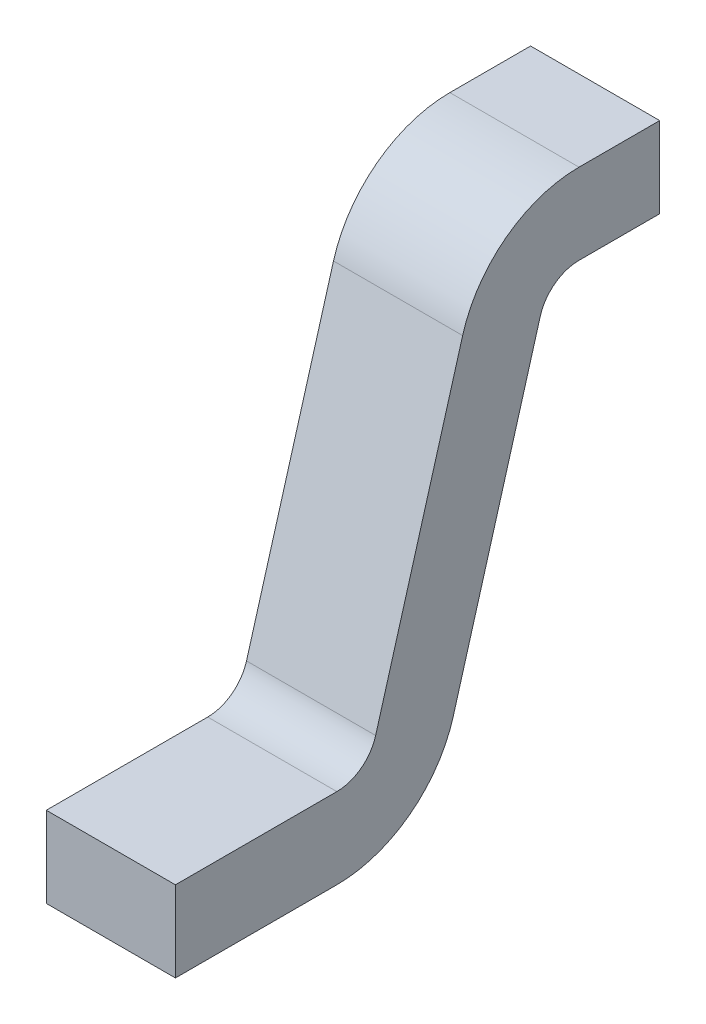
ISO-10303-21;
HEADER;
FILE_DESCRIPTION(('STEP AP214'),'2;1');
FILE_NAME('part.step','',(''),(''),'','','');
FILE_SCHEMA(('AUTOMOTIVE_DESIGN { 1 0 10303 214 1 1 1 1 }'));
ENDSEC;
DATA;
#1=APPLICATION_CONTEXT('core data for automotive mechanical design processes');
#2=APPLICATION_PROTOCOL_DEFINITION('international standard','automotive_design',2000,#1);
#3=PRODUCT_CONTEXT('',#1,'mechanical');
#4=PRODUCT('Part','Part','',(#3));
#5=PRODUCT_RELATED_PRODUCT_CATEGORY('part','',(#4));
#6=PRODUCT_DEFINITION_FORMATION('','',#4);
#7=PRODUCT_DEFINITION_CONTEXT('part definition',#1,'design');
#8=PRODUCT_DEFINITION('design','',#6,#7);
#9=PRODUCT_DEFINITION_SHAPE('','',#8);
#10=(LENGTH_UNIT() NAMED_UNIT(*) SI_UNIT(.MILLI.,.METRE.));
#11=(NAMED_UNIT(*) PLANE_ANGLE_UNIT() SI_UNIT($,.RADIAN.));
#12=(NAMED_UNIT(*) SI_UNIT($,.STERADIAN.) SOLID_ANGLE_UNIT());
#13=UNCERTAINTY_MEASURE_WITH_UNIT(LENGTH_MEASURE(1.E-05),#10,'distance_accuracy_value','');
#14=(GEOMETRIC_REPRESENTATION_CONTEXT(3) GLOBAL_UNCERTAINTY_ASSIGNED_CONTEXT((#13)) GLOBAL_UNIT_ASSIGNED_CONTEXT((#10,
#11,#12)) REPRESENTATION_CONTEXT('',''));
#15=CARTESIAN_POINT('',(0.,0.,0.));
#16=DIRECTION('',(0.,0.,1.));
#17=DIRECTION('',(1.,0.,0.));
#18=AXIS2_PLACEMENT_3D('',#15,#16,#17);
#19=CARTESIAN_POINT('',(0.2,-0.25,0.25));
#20=DIRECTION('',(1.,0.,0.));
#21=DIRECTION('',(0.,0.,-1.));
#22=AXIS2_PLACEMENT_3D('',#19,#20,#21);
#23=PLANE('',#22);
#24=DIRECTION('',(0.,0.961138338326591,-0.276067192181179));
#25=VECTOR('',#24,1.);
#26=CARTESIAN_POINT('',(0.2,-0.215491600977353,0.370142292290824));
#27=LINE('',#26,#25);
#28=CARTESIAN_POINT('',(0.2,-0.215491600977353,0.370142292290824));
#29=VERTEX_POINT('',#28);
#30=CARTESIAN_POINT('',(0.2,-1.15352519706794,0.639573123127529));
#31=VERTEX_POINT('',#30);
#32=EDGE_CURVE('E126',#29,#31,#27,.F.);
#33=ORIENTED_EDGE('',*,*,#32,.F.);
#34=CARTESIAN_POINT('',(0.2,-0.25,0.25));
#35=DIRECTION('',(1.,0.,0.));
#36=DIRECTION('',(0.,0.,-1.));
#37=AXIS2_PLACEMENT_3D('',#34,#35,#36);
#38=CIRCLE('',#37,0.125);
#39=CARTESIAN_POINT('',(0.2,-0.125,0.25));
#40=VERTEX_POINT('',#39);
#41=EDGE_CURVE('E112',#29,#40,#38,.F.);
#42=ORIENTED_EDGE('',*,*,#41,.T.);
#43=DIRECTION('',(0.,0.,-1.));
#44=VECTOR('',#43,1.);
#45=CARTESIAN_POINT('',(0.2,-0.125,0.25));
#46=LINE('',#45,#44);
#47=CARTESIAN_POINT('',(0.2,-0.125,0.));
#48=VERTEX_POINT('',#47);
#49=EDGE_CURVE('E110',#48,#40,#46,.F.);
#50=ORIENTED_EDGE('',*,*,#49,.F.);
#51=DIRECTION('',(0.,1.,0.));
#52=VECTOR('',#51,1.);
#53=CARTESIAN_POINT('',(0.2,0.125,0.));
#54=LINE('',#53,#52);
#55=CARTESIAN_POINT('',(0.2,0.125,0.));
#56=VERTEX_POINT('',#55);
#57=EDGE_CURVE('E95',#48,#56,#54,.T.);
#58=ORIENTED_EDGE('',*,*,#57,.T.);
#59=DIRECTION('',(0.,0.,-1.));
#60=VECTOR('',#59,1.);
#61=CARTESIAN_POINT('',(0.2,0.125,0.25));
#62=LINE('',#61,#60);
#63=CARTESIAN_POINT('',(0.2,0.125,0.25));
#64=VERTEX_POINT('',#63);
#65=EDGE_CURVE('E152',#56,#64,#62,.F.);
#66=ORIENTED_EDGE('',*,*,#65,.T.);
#67=CARTESIAN_POINT('',(0.2,-0.25,0.25));
#68=DIRECTION('',(1.,0.,0.));
#69=DIRECTION('',(0.,0.,-1.));
#70=AXIS2_PLACEMENT_3D('',#67,#68,#69);
#71=CIRCLE('',#70,0.375);
#72=CARTESIAN_POINT('',(0.2,-0.146474802932058,0.610426876872472));
#73=VERTEX_POINT('',#72);
#74=EDGE_CURVE('E21',#73,#64,#71,.F.);
#75=ORIENTED_EDGE('',*,*,#74,.F.);
#76=DIRECTION('',(0.,0.961138338326591,-0.276067192181179));
#77=VECTOR('',#76,1.);
#78=CARTESIAN_POINT('',(0.2,-0.146474802932058,0.610426876872472));
#79=LINE('',#78,#77);
#80=CARTESIAN_POINT('',(0.2,-1.08450839902265,0.879857707709176));
#81=VERTEX_POINT('',#80);
#82=EDGE_CURVE('E148',#73,#81,#79,.F.);
#83=ORIENTED_EDGE('',*,*,#82,.T.);
#84=CARTESIAN_POINT('',(0.2,-1.05,1.));
#85=DIRECTION('',(1.,0.,0.));
#86=DIRECTION('',(0.,0.,-1.));
#87=AXIS2_PLACEMENT_3D('',#84,#85,#86);
#88=CIRCLE('',#87,0.125);
#89=CARTESIAN_POINT('',(0.2,-1.175,1.));
#90=VERTEX_POINT('',#89);
#91=EDGE_CURVE('E175',#81,#90,#88,.F.);
#92=ORIENTED_EDGE('',*,*,#91,.T.);
#93=DIRECTION('',(0.,0.,-1.));
#94=VECTOR('',#93,1.);
#95=CARTESIAN_POINT('',(0.2,-1.175,1.5));
#96=LINE('',#95,#94);
#97=CARTESIAN_POINT('',(0.2,-1.175,1.5));
#98=VERTEX_POINT('',#97);
#99=EDGE_CURVE('E142',#90,#98,#96,.F.);
#100=ORIENTED_EDGE('',*,*,#99,.T.);
#101=DIRECTION('',(0.,1.,0.));
#102=VECTOR('',#101,1.);
#103=CARTESIAN_POINT('',(0.2,-1.425,1.5));
#104=LINE('',#103,#102);
#105=CARTESIAN_POINT('',(0.2,-1.425,1.5));
#106=VERTEX_POINT('',#105);
#107=EDGE_CURVE('E134',#98,#106,#104,.F.);
#108=ORIENTED_EDGE('',*,*,#107,.T.);
#109=DIRECTION('',(0.,0.,-1.));
#110=VECTOR('',#109,1.);
#111=CARTESIAN_POINT('',(0.2,-1.425,1.5));
#112=LINE('',#111,#110);
#113=CARTESIAN_POINT('',(0.2,-1.425,1.));
#114=VERTEX_POINT('',#113);
#115=EDGE_CURVE('E130',#114,#106,#112,.F.);
#116=ORIENTED_EDGE('',*,*,#115,.F.);
#117=CARTESIAN_POINT('',(0.2,-1.05,1.));
#118=DIRECTION('',(1.,0.,0.));
#119=DIRECTION('',(0.,0.,-1.));
#120=AXIS2_PLACEMENT_3D('',#117,#118,#119);
#121=CIRCLE('',#120,0.375);
#122=EDGE_CURVE('E174',#31,#114,#121,.F.);
#123=ORIENTED_EDGE('',*,*,#122,.F.);
#124=EDGE_LOOP('',(#33,#42,#50,#58,#66,#75,#83,#92,#100,#108,#116,#123));
#125=FACE_BOUND('',#124,.T.);
#126=ADVANCED_FACE('F18',(#125),#23,.T.);
#127=CARTESIAN_POINT('',(-0.2,0.125,0.));
#128=DIRECTION('',(0.,0.,1.));
#129=DIRECTION('',(1.,0.,0.));
#130=AXIS2_PLACEMENT_3D('',#127,#128,#129);
#131=PLANE('',#130);
#132=ORIENTED_EDGE('',*,*,#57,.F.);
#133=DIRECTION('',(1.,0.,0.));
#134=VECTOR('',#133,1.);
#135=CARTESIAN_POINT('',(-0.2,-0.125,0.));
#136=LINE('',#135,#134);
#137=CARTESIAN_POINT('',(-0.2,-0.125,0.));
#138=VERTEX_POINT('',#137);
#139=EDGE_CURVE('E105',#138,#48,#136,.T.);
#140=ORIENTED_EDGE('',*,*,#139,.F.);
#141=DIRECTION('',(0.,1.,0.));
#142=VECTOR('',#141,1.);
#143=CARTESIAN_POINT('',(-0.2,-0.25,0.));
#144=LINE('',#143,#142);
#145=CARTESIAN_POINT('',(-0.2,0.125,0.));
#146=VERTEX_POINT('',#145);
#147=EDGE_CURVE('E116',#138,#146,#144,.T.);
#148=ORIENTED_EDGE('',*,*,#147,.T.);
#149=DIRECTION('',(1.,0.,0.));
#150=VECTOR('',#149,1.);
#151=CARTESIAN_POINT('',(-0.2,0.125,0.));
#152=LINE('',#151,#150);
#153=EDGE_CURVE('E107',#146,#56,#152,.T.);
#154=ORIENTED_EDGE('',*,*,#153,.T.);
#155=EDGE_LOOP('',(#132,#140,#148,#154));
#156=FACE_BOUND('',#155,.T.);
#157=ADVANCED_FACE('F103',(#156),#131,.F.);
#158=CARTESIAN_POINT('',(-0.2,0.125,0.25));
#159=DIRECTION('',(0.,-1.,0.));
#160=DIRECTION('',(0.,0.,-1.));
#161=AXIS2_PLACEMENT_3D('',#158,#159,#160);
#162=PLANE('',#161);
#163=ORIENTED_EDGE('',*,*,#65,.F.);
#164=ORIENTED_EDGE('',*,*,#153,.F.);
#165=DIRECTION('',(0.,0.,-1.));
#166=VECTOR('',#165,1.);
#167=CARTESIAN_POINT('',(-0.2,0.125,0.25));
#168=LINE('',#167,#166);
#169=CARTESIAN_POINT('',(-0.2,0.125,0.25));
#170=VERTEX_POINT('',#169);
#171=EDGE_CURVE('E171',#146,#170,#168,.F.);
#172=ORIENTED_EDGE('',*,*,#171,.T.);
#173=DIRECTION('',(1.,0.,0.));
#174=VECTOR('',#173,1.);
#175=CARTESIAN_POINT('',(-0.2,0.125,0.25));
#176=LINE('',#175,#174);
#177=EDGE_CURVE('E187',#64,#170,#176,.F.);
#178=ORIENTED_EDGE('',*,*,#177,.F.);
#179=EDGE_LOOP('',(#163,#164,#172,#178));
#180=FACE_BOUND('',#179,.T.);
#181=ADVANCED_FACE('F200',(#180),#162,.F.);
#182=CARTESIAN_POINT('',(-0.2,-0.25,0.25));
#183=DIRECTION('',(1.,0.,0.));
#184=DIRECTION('',(0.,0.,-1.));
#185=AXIS2_PLACEMENT_3D('',#182,#183,#184);
#186=CYLINDRICAL_SURFACE('',#185,0.375);
#187=ORIENTED_EDGE('',*,*,#177,.T.);
#188=CARTESIAN_POINT('',(-0.2,-0.25,0.25));
#189=DIRECTION('',(1.,0.,0.));
#190=DIRECTION('',(0.,0.,-1.));
#191=AXIS2_PLACEMENT_3D('',#188,#189,#190);
#192=CIRCLE('',#191,0.375);
#193=CARTESIAN_POINT('',(-0.2,-0.146474802932058,0.610426876872472));
#194=VERTEX_POINT('',#193);
#195=EDGE_CURVE('E168',#170,#194,#192,.T.);
#196=ORIENTED_EDGE('',*,*,#195,.T.);
#197=DIRECTION('',(1.,0.,0.));
#198=VECTOR('',#197,1.);
#199=CARTESIAN_POINT('',(-0.2,-0.146474802932058,0.610426876872472));
#200=LINE('',#199,#198);
#201=EDGE_CURVE('E151',#194,#73,#200,.T.);
#202=ORIENTED_EDGE('',*,*,#201,.T.);
#203=ORIENTED_EDGE('',*,*,#74,.T.);
#204=EDGE_LOOP('',(#187,#196,#202,#203));
#205=FACE_BOUND('',#204,.T.);
#206=ADVANCED_FACE('F190',(#205),#186,.T.);
#207=CARTESIAN_POINT('',(-0.2,-0.146474802932058,0.610426876872472));
#208=DIRECTION('',(0.,-0.276067192181179,-0.961138338326591));
#209=DIRECTION('',(0.,0.961138338326591,-0.276067192181179));
#210=AXIS2_PLACEMENT_3D('',#207,#208,#209);
#211=PLANE('',#210);
#212=ORIENTED_EDGE('',*,*,#82,.F.);
#213=ORIENTED_EDGE('',*,*,#201,.F.);
#214=DIRECTION('',(0.,-0.961138338326591,0.276067192181179));
#215=VECTOR('',#214,1.);
#216=CARTESIAN_POINT('',(-0.2,-0.146474802932058,0.610426876872472));
#217=LINE('',#216,#215);
#218=CARTESIAN_POINT('',(-0.2,-1.08450839902265,0.879857707709176));
#219=VERTEX_POINT('',#218);
#220=EDGE_CURVE('E167',#194,#219,#217,.T.);
#221=ORIENTED_EDGE('',*,*,#220,.T.);
#222=DIRECTION('',(1.,0.,0.));
#223=VECTOR('',#222,1.);
#224=CARTESIAN_POINT('',(-0.2,-1.08450839902265,0.879857707709176));
#225=LINE('',#224,#223);
#226=EDGE_CURVE('E150',#219,#81,#225,.T.);
#227=ORIENTED_EDGE('',*,*,#226,.T.);
#228=EDGE_LOOP('',(#212,#213,#221,#227));
#229=FACE_BOUND('',#228,.T.);
#230=ADVANCED_FACE('F339',(#229),#211,.F.);
#231=CARTESIAN_POINT('',(-0.2,-1.05,1.));
#232=DIRECTION('',(1.,0.,0.));
#233=DIRECTION('',(0.,0.,-1.));
#234=AXIS2_PLACEMENT_3D('',#231,#232,#233);
#235=CYLINDRICAL_SURFACE('',#234,0.125);
#236=ORIENTED_EDGE('',*,*,#91,.F.);
#237=ORIENTED_EDGE('',*,*,#226,.F.);
#238=CARTESIAN_POINT('',(-0.2,-1.05,1.));
#239=DIRECTION('',(1.,0.,0.));
#240=DIRECTION('',(0.,0.,-1.));
#241=AXIS2_PLACEMENT_3D('',#238,#239,#240);
#242=CIRCLE('',#241,0.125);
#243=CARTESIAN_POINT('',(-0.2,-1.175,1.));
#244=VERTEX_POINT('',#243);
#245=EDGE_CURVE('E163',#219,#244,#242,.F.);
#246=ORIENTED_EDGE('',*,*,#245,.T.);
#247=DIRECTION('',(1.,0.,0.));
#248=VECTOR('',#247,1.);
#249=CARTESIAN_POINT('',(-0.2,-1.175,1.));
#250=LINE('',#249,#248);
#251=EDGE_CURVE('E145',#244,#90,#250,.T.);
#252=ORIENTED_EDGE('',*,*,#251,.T.);
#253=EDGE_LOOP('',(#236,#237,#246,#252));
#254=FACE_BOUND('',#253,.T.);
#255=ADVANCED_FACE('F330',(#254),#235,.F.);
#256=CARTESIAN_POINT('',(-0.2,-1.175,1.5));
#257=DIRECTION('',(0.,-1.,0.));
#258=DIRECTION('',(0.,0.,-1.));
#259=AXIS2_PLACEMENT_3D('',#256,#257,#258);
#260=PLANE('',#259);
#261=ORIENTED_EDGE('',*,*,#99,.F.);
#262=ORIENTED_EDGE('',*,*,#251,.F.);
#263=DIRECTION('',(0.,0.,-1.));
#264=VECTOR('',#263,1.);
#265=CARTESIAN_POINT('',(-0.2,-1.175,0.25));
#266=LINE('',#265,#264);
#267=CARTESIAN_POINT('',(-0.2,-1.175,1.5));
#268=VERTEX_POINT('',#267);
#269=EDGE_CURVE('E166',#244,#268,#266,.F.);
#270=ORIENTED_EDGE('',*,*,#269,.T.);
#271=DIRECTION('',(-1.,0.,0.));
#272=VECTOR('',#271,1.);
#273=CARTESIAN_POINT('',(-0.2,-1.175,1.5));
#274=LINE('',#273,#272);
#275=EDGE_CURVE('E139',#268,#98,#274,.F.);
#276=ORIENTED_EDGE('',*,*,#275,.T.);
#277=EDGE_LOOP('',(#261,#262,#270,#276));
#278=FACE_BOUND('',#277,.T.);
#279=ADVANCED_FACE('F230',(#278),#260,.F.);
#280=CARTESIAN_POINT('',(-0.2,-1.425,1.5));
#281=DIRECTION('',(0.,0.,-1.));
#282=DIRECTION('',(-1.,0.,0.));
#283=AXIS2_PLACEMENT_3D('',#280,#281,#282);
#284=PLANE('',#283);
#285=ORIENTED_EDGE('',*,*,#107,.F.);
#286=ORIENTED_EDGE('',*,*,#275,.F.);
#287=DIRECTION('',(0.,1.,0.));
#288=VECTOR('',#287,1.);
#289=CARTESIAN_POINT('',(-0.2,-0.25,1.5));
#290=LINE('',#289,#288);
#291=CARTESIAN_POINT('',(-0.2,-1.425,1.5));
#292=VERTEX_POINT('',#291);
#293=EDGE_CURVE('E220',#268,#292,#290,.F.);
#294=ORIENTED_EDGE('',*,*,#293,.T.);
#295=DIRECTION('',(1.,0.,0.));
#296=VECTOR('',#295,1.);
#297=CARTESIAN_POINT('',(-0.2,-1.425,1.5));
#298=LINE('',#297,#296);
#299=EDGE_CURVE('E133',#106,#292,#298,.F.);
#300=ORIENTED_EDGE('',*,*,#299,.F.);
#301=EDGE_LOOP('',(#285,#286,#294,#300));
#302=FACE_BOUND('',#301,.T.);
#303=ADVANCED_FACE('F235',(#302),#284,.F.);
#304=CARTESIAN_POINT('',(-0.2,-1.425,1.5));
#305=DIRECTION('',(0.,-1.,0.));
#306=DIRECTION('',(0.,0.,-1.));
#307=AXIS2_PLACEMENT_3D('',#304,#305,#306);
#308=PLANE('',#307);
#309=ORIENTED_EDGE('',*,*,#299,.T.);
#310=DIRECTION('',(0.,0.,-1.));
#311=VECTOR('',#310,1.);
#312=CARTESIAN_POINT('',(-0.2,-1.425,0.25));
#313=LINE('',#312,#311);
#314=CARTESIAN_POINT('',(-0.2,-1.425,1.));
#315=VERTEX_POINT('',#314);
#316=EDGE_CURVE('E162',#292,#315,#313,.T.);
#317=ORIENTED_EDGE('',*,*,#316,.T.);
#318=DIRECTION('',(1.,0.,0.));
#319=VECTOR('',#318,1.);
#320=CARTESIAN_POINT('',(-0.2,-1.425,1.));
#321=LINE('',#320,#319);
#322=EDGE_CURVE('E129',#114,#315,#321,.F.);
#323=ORIENTED_EDGE('',*,*,#322,.F.);
#324=ORIENTED_EDGE('',*,*,#115,.T.);
#325=EDGE_LOOP('',(#309,#317,#323,#324));
#326=FACE_BOUND('',#325,.T.);
#327=ADVANCED_FACE('F261',(#326),#308,.T.);
#328=CARTESIAN_POINT('',(-0.2,-1.05,1.));
#329=DIRECTION('',(1.,0.,0.));
#330=DIRECTION('',(0.,0.,-1.));
#331=AXIS2_PLACEMENT_3D('',#328,#329,#330);
#332=CYLINDRICAL_SURFACE('',#331,0.375);
#333=ORIENTED_EDGE('',*,*,#322,.T.);
#334=CARTESIAN_POINT('',(-0.2,-1.05,1.));
#335=DIRECTION('',(1.,0.,0.));
#336=DIRECTION('',(0.,0.,-1.));
#337=AXIS2_PLACEMENT_3D('',#334,#335,#336);
#338=CIRCLE('',#337,0.375);
#339=CARTESIAN_POINT('',(-0.2,-1.15352519706794,0.639573123127529));
#340=VERTEX_POINT('',#339);
#341=EDGE_CURVE('E159',#315,#340,#338,.T.);
#342=ORIENTED_EDGE('',*,*,#341,.T.);
#343=DIRECTION('',(1.,0.,0.));
#344=VECTOR('',#343,1.);
#345=CARTESIAN_POINT('',(-0.2,-1.15352519706794,0.639573123127529));
#346=LINE('',#345,#344);
#347=EDGE_CURVE('E128',#31,#340,#346,.F.);
#348=ORIENTED_EDGE('',*,*,#347,.F.);
#349=ORIENTED_EDGE('',*,*,#122,.T.);
#350=EDGE_LOOP('',(#333,#342,#348,#349));
#351=FACE_BOUND('',#350,.T.);
#352=ADVANCED_FACE('F258',(#351),#332,.T.);
#353=CARTESIAN_POINT('',(-0.2,-0.215491600977353,0.370142292290824));
#354=DIRECTION('',(0.,-0.276067192181179,-0.961138338326591));
#355=DIRECTION('',(0.,0.961138338326591,-0.276067192181179));
#356=AXIS2_PLACEMENT_3D('',#353,#354,#355);
#357=PLANE('',#356);
#358=ORIENTED_EDGE('',*,*,#347,.T.);
#359=DIRECTION('',(0.,0.961138338326591,-0.276067192181179));
#360=VECTOR('',#359,1.);
#361=CARTESIAN_POINT('',(-0.2,-1.15352519706794,0.639573123127529));
#362=LINE('',#361,#360);
#363=CARTESIAN_POINT('',(-0.2,-0.215491600977353,0.370142292290824));
#364=VERTEX_POINT('',#363);
#365=EDGE_CURVE('E158',#340,#364,#362,.T.);
#366=ORIENTED_EDGE('',*,*,#365,.T.);
#367=DIRECTION('',(1.,0.,0.));
#368=VECTOR('',#367,1.);
#369=CARTESIAN_POINT('',(-0.2,-0.215491600977353,0.370142292290824));
#370=LINE('',#369,#368);
#371=EDGE_CURVE('E173',#364,#29,#370,.T.);
#372=ORIENTED_EDGE('',*,*,#371,.T.);
#373=ORIENTED_EDGE('',*,*,#32,.T.);
#374=EDGE_LOOP('',(#358,#366,#372,#373));
#375=FACE_BOUND('',#374,.T.);
#376=ADVANCED_FACE('F255',(#375),#357,.T.);
#377=CARTESIAN_POINT('',(-0.2,-0.25,0.25));
#378=DIRECTION('',(1.,0.,0.));
#379=DIRECTION('',(0.,0.,-1.));
#380=AXIS2_PLACEMENT_3D('',#377,#378,#379);
#381=CYLINDRICAL_SURFACE('',#380,0.125);
#382=ORIENTED_EDGE('',*,*,#41,.F.);
#383=ORIENTED_EDGE('',*,*,#371,.F.);
#384=CARTESIAN_POINT('',(-0.2,-0.25,0.25));
#385=DIRECTION('',(1.,0.,0.));
#386=DIRECTION('',(0.,0.,-1.));
#387=AXIS2_PLACEMENT_3D('',#384,#385,#386);
#388=CIRCLE('',#387,0.125);
#389=CARTESIAN_POINT('',(-0.2,-0.125,0.25));
#390=VERTEX_POINT('',#389);
#391=EDGE_CURVE('E27',#364,#390,#388,.F.);
#392=ORIENTED_EDGE('',*,*,#391,.T.);
#393=DIRECTION('',(1.,0.,0.));
#394=VECTOR('',#393,1.);
#395=CARTESIAN_POINT('',(-0.2,-0.125,0.25));
#396=LINE('',#395,#394);
#397=EDGE_CURVE('E35',#40,#390,#396,.F.);
#398=ORIENTED_EDGE('',*,*,#397,.F.);
#399=EDGE_LOOP('',(#382,#383,#392,#398));
#400=FACE_BOUND('',#399,.T.);
#401=ADVANCED_FACE('F264',(#400),#381,.F.);
#402=CARTESIAN_POINT('',(-0.2,-0.125,0.25));
#403=DIRECTION('',(0.,-1.,0.));
#404=DIRECTION('',(0.,0.,-1.));
#405=AXIS2_PLACEMENT_3D('',#402,#403,#404);
#406=PLANE('',#405);
#407=ORIENTED_EDGE('',*,*,#397,.T.);
#408=DIRECTION('',(0.,0.,-1.));
#409=VECTOR('',#408,1.);
#410=CARTESIAN_POINT('',(-0.2,-0.125,0.25));
#411=LINE('',#410,#409);
#412=EDGE_CURVE('E11',#390,#138,#411,.T.);
#413=ORIENTED_EDGE('',*,*,#412,.T.);
#414=ORIENTED_EDGE('',*,*,#139,.T.);
#415=ORIENTED_EDGE('',*,*,#49,.T.);
#416=EDGE_LOOP('',(#407,#413,#414,#415));
#417=FACE_BOUND('',#416,.T.);
#418=ADVANCED_FACE('F109',(#417),#406,.T.);
#419=CARTESIAN_POINT('',(-0.2,-0.25,0.25));
#420=DIRECTION('',(1.,0.,0.));
#421=DIRECTION('',(0.,0.,-1.));
#422=AXIS2_PLACEMENT_3D('',#419,#420,#421);
#423=PLANE('',#422);
#424=ORIENTED_EDGE('',*,*,#391,.F.);
#425=ORIENTED_EDGE('',*,*,#365,.F.);
#426=ORIENTED_EDGE('',*,*,#341,.F.);
#427=ORIENTED_EDGE('',*,*,#316,.F.);
#428=ORIENTED_EDGE('',*,*,#293,.F.);
#429=ORIENTED_EDGE('',*,*,#269,.F.);
#430=ORIENTED_EDGE('',*,*,#245,.F.);
#431=ORIENTED_EDGE('',*,*,#220,.F.);
#432=ORIENTED_EDGE('',*,*,#195,.F.);
#433=ORIENTED_EDGE('',*,*,#171,.F.);
#434=ORIENTED_EDGE('',*,*,#147,.F.);
#435=ORIENTED_EDGE('',*,*,#412,.F.);
#436=EDGE_LOOP('',(#424,#425,#426,#427,#428,#429,#430,#431,#432,#433,#434,#435));
#437=FACE_BOUND('',#436,.T.);
#438=ADVANCED_FACE('F197',(#437),#423,.F.);
#439=CLOSED_SHELL('',(#126,#157,#181,#206,#230,#255,#279,#303,#327,#352,#376,#401,#418,#438));
#440=MANIFOLD_SOLID_BREP('B1',#439);
#441=ADVANCED_BREP_SHAPE_REPRESENTATION('',(#18,#440),#14);
#442=SHAPE_DEFINITION_REPRESENTATION(#9,#441);
ENDSEC;
END-ISO-10303-21;
